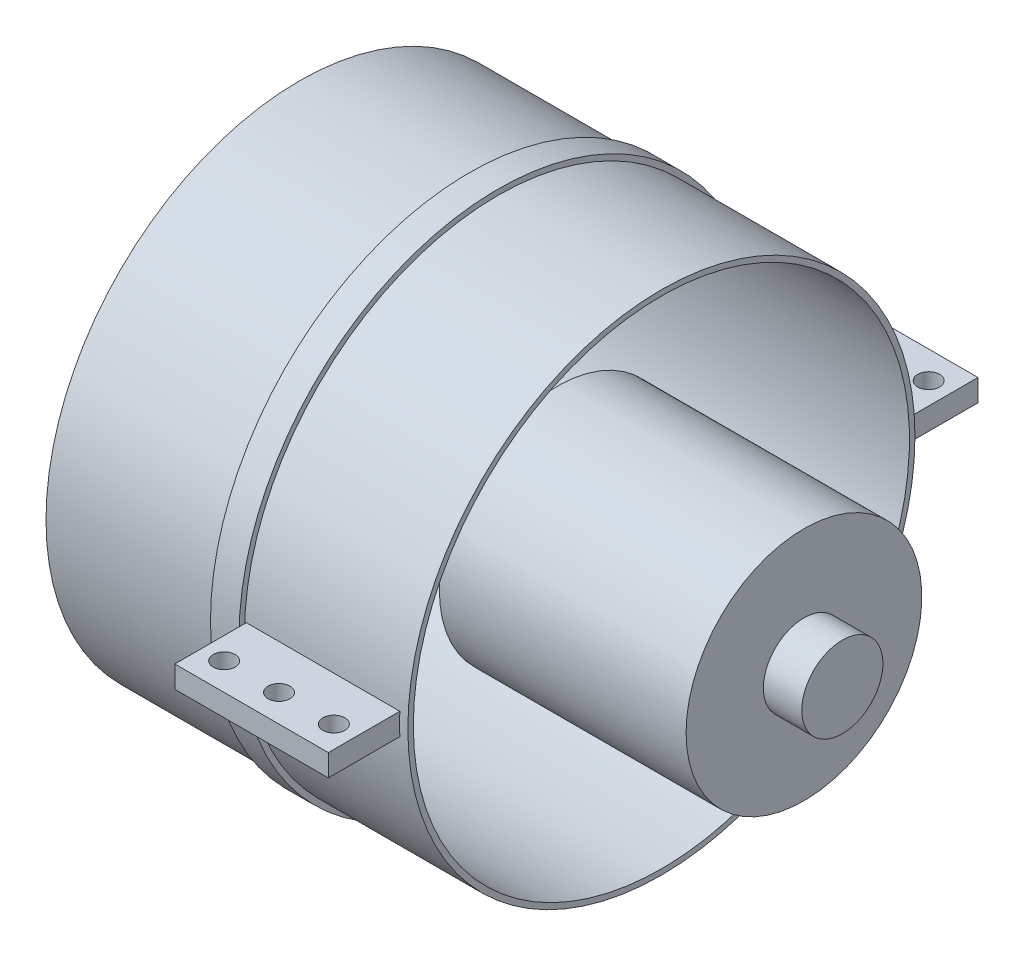
ISO-10303-21;
HEADER;
FILE_DESCRIPTION(('STEP AP214'),'2;1');
FILE_NAME('part.step','',(''),(''),'','','');
FILE_SCHEMA(('AUTOMOTIVE_DESIGN { 1 0 10303 214 1 1 1 1 }'));
ENDSEC;
DATA;
#1=APPLICATION_CONTEXT('core data for automotive mechanical design processes');
#2=APPLICATION_PROTOCOL_DEFINITION('international standard','automotive_design',2000,#1);
#3=PRODUCT_CONTEXT('',#1,'mechanical');
#4=PRODUCT('Part','Part','',(#3));
#5=PRODUCT_RELATED_PRODUCT_CATEGORY('part','',(#4));
#6=PRODUCT_DEFINITION_FORMATION('','',#4);
#7=PRODUCT_DEFINITION_CONTEXT('part definition',#1,'design');
#8=PRODUCT_DEFINITION('design','',#6,#7);
#9=PRODUCT_DEFINITION_SHAPE('','',#8);
#10=(LENGTH_UNIT() NAMED_UNIT(*) SI_UNIT(.MILLI.,.METRE.));
#11=(NAMED_UNIT(*) PLANE_ANGLE_UNIT() SI_UNIT($,.RADIAN.));
#12=(NAMED_UNIT(*) SI_UNIT($,.STERADIAN.) SOLID_ANGLE_UNIT());
#13=UNCERTAINTY_MEASURE_WITH_UNIT(LENGTH_MEASURE(1.E-05),#10,'distance_accuracy_value','');
#14=(GEOMETRIC_REPRESENTATION_CONTEXT(3) GLOBAL_UNCERTAINTY_ASSIGNED_CONTEXT((#13)) GLOBAL_UNIT_ASSIGNED_CONTEXT((#10,
#11,#12)) REPRESENTATION_CONTEXT('',''));
#15=CARTESIAN_POINT('',(0.,0.,0.));
#16=DIRECTION('',(0.,0.,1.));
#17=DIRECTION('',(1.,0.,0.));
#18=AXIS2_PLACEMENT_3D('',#15,#16,#17);
#19=CARTESIAN_POINT('',(47.,0.,0.));
#20=DIRECTION('',(1.,0.,0.));
#21=DIRECTION('',(0.,0.,-1.));
#22=AXIS2_PLACEMENT_3D('',#19,#20,#21);
#23=PLANE('',#22);
#24=CARTESIAN_POINT('',(47.,0.,0.));
#25=DIRECTION('',(-1.,0.,0.));
#26=DIRECTION('',(0.,0.,1.));
#27=AXIS2_PLACEMENT_3D('',#24,#25,#26);
#28=CIRCLE('',#27,21.5);
#29=CARTESIAN_POINT('',(47.,0.,21.5));
#30=VERTEX_POINT('',#29);
#31=EDGE_CURVE('E11',#30,#30,#28,.T.);
#32=ORIENTED_EDGE('',*,*,#31,.T.);
#33=EDGE_LOOP('',(#32));
#34=FACE_BOUND('',#33,.T.);
#35=ADVANCED_FACE('F40',(#34),#23,.F.);
#36=CARTESIAN_POINT('',(0.,0.,0.));
#37=DIRECTION('',(-1.,0.,0.));
#38=DIRECTION('',(0.,0.,1.));
#39=AXIS2_PLACEMENT_3D('',#36,#37,#38);
#40=CYLINDRICAL_SURFACE('',#39,21.5);
#41=ORIENTED_EDGE('',*,*,#31,.F.);
#42=EDGE_LOOP('',(#41));
#43=FACE_BOUND('',#42,.T.);
#44=CARTESIAN_POINT('',(92.,0.,0.));
#45=DIRECTION('',(-1.,0.,0.));
#46=DIRECTION('',(0.,0.,1.));
#47=AXIS2_PLACEMENT_3D('',#44,#45,#46);
#48=CIRCLE('',#47,21.5);
#49=CARTESIAN_POINT('',(92.,0.,21.5));
#50=VERTEX_POINT('',#49);
#51=EDGE_CURVE('E46',#50,#50,#48,.T.);
#52=ORIENTED_EDGE('',*,*,#51,.T.);
#53=EDGE_LOOP('',(#52));
#54=FACE_BOUND('',#53,.T.);
#55=ADVANCED_FACE('F72',(#43,#54),#40,.T.);
#56=CARTESIAN_POINT('',(92.,0.,-21.5));
#57=DIRECTION('',(-1.,0.,0.));
#58=DIRECTION('',(0.,0.,1.));
#59=AXIS2_PLACEMENT_3D('',#56,#57,#58);
#60=PLANE('',#59);
#61=ORIENTED_EDGE('',*,*,#51,.F.);
#62=EDGE_LOOP('',(#61));
#63=FACE_BOUND('',#62,.T.);
#64=CARTESIAN_POINT('',(92.,0.,0.));
#65=DIRECTION('',(-1.,0.,0.));
#66=DIRECTION('',(0.,0.,1.));
#67=AXIS2_PLACEMENT_3D('',#64,#65,#66);
#68=CIRCLE('',#67,7.4);
#69=CARTESIAN_POINT('',(92.,0.,7.4));
#70=VERTEX_POINT('',#69);
#71=EDGE_CURVE('E50',#70,#70,#68,.T.);
#72=ORIENTED_EDGE('',*,*,#71,.T.);
#73=EDGE_LOOP('',(#72));
#74=FACE_BOUND('',#73,.T.);
#75=ADVANCED_FACE('F68',(#63,#74),#60,.F.);
#76=CARTESIAN_POINT('',(0.,0.,0.));
#77=DIRECTION('',(-1.,0.,0.));
#78=DIRECTION('',(0.,0.,1.));
#79=AXIS2_PLACEMENT_3D('',#76,#77,#78);
#80=CYLINDRICAL_SURFACE('',#79,7.4);
#81=ORIENTED_EDGE('',*,*,#71,.F.);
#82=EDGE_LOOP('',(#81));
#83=FACE_BOUND('',#82,.T.);
#84=CARTESIAN_POINT('',(99.,0.,0.));
#85=DIRECTION('',(-1.,0.,0.));
#86=DIRECTION('',(0.,0.,1.));
#87=AXIS2_PLACEMENT_3D('',#84,#85,#86);
#88=CIRCLE('',#87,7.4);
#89=CARTESIAN_POINT('',(99.,0.,7.4));
#90=VERTEX_POINT('',#89);
#91=EDGE_CURVE('E54',#90,#90,#88,.T.);
#92=ORIENTED_EDGE('',*,*,#91,.T.);
#93=EDGE_LOOP('',(#92));
#94=FACE_BOUND('',#93,.T.);
#95=ADVANCED_FACE('F60',(#83,#94),#80,.T.);
#96=CARTESIAN_POINT('',(99.,0.,-7.4));
#97=DIRECTION('',(-1.,0.,0.));
#98=DIRECTION('',(0.,0.,1.));
#99=AXIS2_PLACEMENT_3D('',#96,#97,#98);
#100=PLANE('',#99);
#101=ORIENTED_EDGE('',*,*,#91,.F.);
#102=EDGE_LOOP('',(#101));
#103=FACE_BOUND('',#102,.T.);
#104=ADVANCED_FACE('F62',(#103),#100,.F.);
#105=CLOSED_SHELL('',(#35,#55,#75,#95,#104));
#106=MANIFOLD_SOLID_BREP('B2',#105);
#107=CARTESIAN_POINT('',(0.,0.,0.));
#108=DIRECTION('',(-1.,0.,0.));
#109=DIRECTION('',(0.,0.,1.));
#110=AXIS2_PLACEMENT_3D('',#107,#108,#109);
#111=CYLINDRICAL_SURFACE('',#110,45.25);
#112=CARTESIAN_POINT('',(66.,0.,0.));
#113=DIRECTION('',(-1.,0.,0.));
#114=DIRECTION('',(0.,0.,1.));
#115=AXIS2_PLACEMENT_3D('',#112,#113,#114);
#116=CIRCLE('',#115,45.25);
#117=CARTESIAN_POINT('',(66.,0.,45.25));
#118=VERTEX_POINT('',#117);
#119=EDGE_CURVE('E253',#118,#118,#116,.T.);
#120=ORIENTED_EDGE('',*,*,#119,.F.);
#121=EDGE_LOOP('',(#120));
#122=FACE_BOUND('',#121,.T.);
#123=CARTESIAN_POINT('',(0.,0.,0.));
#124=DIRECTION('',(-1.,0.,0.));
#125=DIRECTION('',(0.,0.,1.));
#126=AXIS2_PLACEMENT_3D('',#123,#124,#125);
#127=CIRCLE('',#126,45.25);
#128=CARTESIAN_POINT('',(0.,0.,45.25));
#129=VERTEX_POINT('',#128);
#130=EDGE_CURVE('E38',#129,#129,#127,.T.);
#131=ORIENTED_EDGE('',*,*,#130,.T.);
#132=EDGE_LOOP('',(#131));
#133=FACE_BOUND('',#132,.T.);
#134=ADVANCED_FACE('F110',(#122,#133),#111,.F.);
#135=CARTESIAN_POINT('',(0.,0.,-45.25));
#136=DIRECTION('',(1.,0.,0.));
#137=DIRECTION('',(0.,0.,-1.));
#138=AXIS2_PLACEMENT_3D('',#135,#136,#137);
#139=PLANE('',#138);
#140=ORIENTED_EDGE('',*,*,#130,.F.);
#141=EDGE_LOOP('',(#140));
#142=FACE_BOUND('',#141,.T.);
#143=CARTESIAN_POINT('',(0.,0.,0.));
#144=DIRECTION('',(-1.,0.,0.));
#145=DIRECTION('',(0.,0.,1.));
#146=AXIS2_PLACEMENT_3D('',#143,#144,#145);
#147=CIRCLE('',#146,46.25);
#148=CARTESIAN_POINT('',(0.,0.,46.25));
#149=VERTEX_POINT('',#148);
#150=EDGE_CURVE('E118',#149,#149,#147,.T.);
#151=ORIENTED_EDGE('',*,*,#150,.T.);
#152=EDGE_LOOP('',(#151));
#153=FACE_BOUND('',#152,.T.);
#154=ADVANCED_FACE('F335',(#142,#153),#139,.F.);
#155=CARTESIAN_POINT('',(0.,0.,0.));
#156=DIRECTION('',(-1.,0.,0.));
#157=DIRECTION('',(0.,0.,1.));
#158=AXIS2_PLACEMENT_3D('',#155,#156,#157);
#159=CYLINDRICAL_SURFACE('',#158,46.25);
#160=ORIENTED_EDGE('',*,*,#150,.F.);
#161=EDGE_LOOP('',(#160));
#162=FACE_BOUND('',#161,.T.);
#163=CARTESIAN_POINT('',(31.,0.,0.));
#164=DIRECTION('',(-1.,0.,0.));
#165=DIRECTION('',(0.,0.,1.));
#166=AXIS2_PLACEMENT_3D('',#163,#164,#165);
#167=CIRCLE('',#166,46.25);
#168=CARTESIAN_POINT('',(31.,0.,46.25));
#169=VERTEX_POINT('',#168);
#170=EDGE_CURVE('E273',#169,#169,#167,.T.);
#171=ORIENTED_EDGE('',*,*,#170,.T.);
#172=EDGE_LOOP('',(#171));
#173=FACE_BOUND('',#172,.T.);
#174=ADVANCED_FACE('F340',(#162,#173),#159,.T.);
#175=CARTESIAN_POINT('',(31.,0.,-46.25));
#176=DIRECTION('',(1.,0.,0.));
#177=DIRECTION('',(0.,0.,-1.));
#178=AXIS2_PLACEMENT_3D('',#175,#176,#177);
#179=PLANE('',#178);
#180=ORIENTED_EDGE('',*,*,#170,.F.);
#181=EDGE_LOOP('',(#180));
#182=FACE_BOUND('',#181,.T.);
#183=CARTESIAN_POINT('',(31.,0.,0.));
#184=DIRECTION('',(-1.,0.,0.));
#185=DIRECTION('',(0.,0.,1.));
#186=AXIS2_PLACEMENT_3D('',#183,#184,#185);
#187=CIRCLE('',#186,47.25);
#188=CARTESIAN_POINT('',(31.,0.,47.25));
#189=VERTEX_POINT('',#188);
#190=EDGE_CURVE('E270',#189,#189,#187,.T.);
#191=ORIENTED_EDGE('',*,*,#190,.T.);
#192=EDGE_LOOP('',(#191));
#193=FACE_BOUND('',#192,.T.);
#194=ADVANCED_FACE('F345',(#182,#193),#179,.F.);
#195=CARTESIAN_POINT('',(0.,0.,0.));
#196=DIRECTION('',(-1.,0.,0.));
#197=DIRECTION('',(0.,0.,1.));
#198=AXIS2_PLACEMENT_3D('',#195,#196,#197);
#199=CYLINDRICAL_SURFACE('',#198,47.25);
#200=ORIENTED_EDGE('',*,*,#190,.F.);
#201=EDGE_LOOP('',(#200));
#202=FACE_BOUND('',#201,.T.);
#203=CARTESIAN_POINT('',(36.2,0.,0.));
#204=DIRECTION('',(-1.,0.,0.));
#205=DIRECTION('',(0.,0.,1.));
#206=AXIS2_PLACEMENT_3D('',#203,#204,#205);
#207=CIRCLE('',#206,47.25);
#208=CARTESIAN_POINT('',(36.2,0.,47.25));
#209=VERTEX_POINT('',#208);
#210=EDGE_CURVE('E267',#209,#209,#207,.T.);
#211=ORIENTED_EDGE('',*,*,#210,.T.);
#212=EDGE_LOOP('',(#211));
#213=FACE_BOUND('',#212,.T.);
#214=ADVANCED_FACE('F351',(#202,#213),#199,.T.);
#215=CARTESIAN_POINT('',(36.2,0.,-47.25));
#216=DIRECTION('',(-1.,0.,0.));
#217=DIRECTION('',(0.,0.,1.));
#218=AXIS2_PLACEMENT_3D('',#215,#216,#217);
#219=PLANE('',#218);
#220=ORIENTED_EDGE('',*,*,#210,.F.);
#221=EDGE_LOOP('',(#220));
#222=FACE_BOUND('',#221,.T.);
#223=CARTESIAN_POINT('',(36.2,0.,0.));
#224=DIRECTION('',(-1.,0.,0.));
#225=DIRECTION('',(0.,0.,1.));
#226=AXIS2_PLACEMENT_3D('',#223,#224,#225);
#227=CIRCLE('',#226,46.25);
#228=CARTESIAN_POINT('',(36.2,0.,46.25));
#229=VERTEX_POINT('',#228);
#230=EDGE_CURVE('E264',#229,#229,#227,.T.);
#231=ORIENTED_EDGE('',*,*,#230,.T.);
#232=EDGE_LOOP('',(#231));
#233=FACE_BOUND('',#232,.T.);
#234=ADVANCED_FACE('F319',(#222,#233),#219,.F.);
#235=CARTESIAN_POINT('',(0.,0.,0.));
#236=DIRECTION('',(-1.,0.,0.));
#237=DIRECTION('',(0.,0.,1.));
#238=AXIS2_PLACEMENT_3D('',#235,#236,#237);
#239=CYLINDRICAL_SURFACE('',#238,46.25);
#240=DIRECTION('',(1.,0.,0.));
#241=VECTOR('',#240,1.);
#242=CARTESIAN_POINT('',(36.5,-2.,46.2067365218536));
#243=LINE('',#242,#241);
#244=CARTESIAN_POINT('',(36.5,-2.,46.2067365218536));
#245=VERTEX_POINT('',#244);
#246=CARTESIAN_POINT('',(64.5,-2.,46.2067365218536));
#247=VERTEX_POINT('',#246);
#248=EDGE_CURVE('E126',#245,#247,#243,.T.);
#249=ORIENTED_EDGE('',*,*,#248,.F.);
#250=CARTESIAN_POINT('',(36.5,0.,0.));
#251=DIRECTION('',(-1.,0.,0.));
#252=DIRECTION('',(0.,0.,-1.));
#253=AXIS2_PLACEMENT_3D('',#250,#251,#252);
#254=CIRCLE('',#253,46.25);
#255=CARTESIAN_POINT('',(36.5,2.,46.2067365218536));
#256=VERTEX_POINT('',#255);
#257=EDGE_CURVE('E130',#245,#256,#254,.T.);
#258=ORIENTED_EDGE('',*,*,#257,.T.);
#259=DIRECTION('',(1.,0.,0.));
#260=VECTOR('',#259,1.);
#261=CARTESIAN_POINT('',(36.5,2.,46.2067365218536));
#262=LINE('',#261,#260);
#263=CARTESIAN_POINT('',(64.5,2.,46.2067365218536));
#264=VERTEX_POINT('',#263);
#265=EDGE_CURVE('E186',#256,#264,#262,.T.);
#266=ORIENTED_EDGE('',*,*,#265,.T.);
#267=CARTESIAN_POINT('',(64.5,0.,0.));
#268=DIRECTION('',(-1.,0.,0.));
#269=DIRECTION('',(0.,0.,-1.));
#270=AXIS2_PLACEMENT_3D('',#267,#268,#269);
#271=CIRCLE('',#270,46.25);
#272=EDGE_CURVE('E202',#247,#264,#271,.T.);
#273=ORIENTED_EDGE('',*,*,#272,.F.);
#274=EDGE_LOOP('',(#249,#258,#266,#273));
#275=FACE_BOUND('',#274,.T.);
#276=DIRECTION('',(1.,0.,0.));
#277=VECTOR('',#276,1.);
#278=CARTESIAN_POINT('',(36.5,2.,-46.2067365218536));
#279=LINE('',#278,#277);
#280=CARTESIAN_POINT('',(36.5,2.,-46.2067365218536));
#281=VERTEX_POINT('',#280);
#282=CARTESIAN_POINT('',(64.5,2.,-46.2067365218536));
#283=VERTEX_POINT('',#282);
#284=EDGE_CURVE('E250',#281,#283,#279,.T.);
#285=ORIENTED_EDGE('',*,*,#284,.F.);
#286=CARTESIAN_POINT('',(36.5,0.,0.));
#287=DIRECTION('',(-1.,0.,0.));
#288=DIRECTION('',(0.,0.,1.));
#289=AXIS2_PLACEMENT_3D('',#286,#287,#288);
#290=CIRCLE('',#289,46.25);
#291=CARTESIAN_POINT('',(36.5,-2.,-46.2067365218536));
#292=VERTEX_POINT('',#291);
#293=EDGE_CURVE('E226',#281,#292,#290,.T.);
#294=ORIENTED_EDGE('',*,*,#293,.T.);
#295=DIRECTION('',(1.,0.,0.));
#296=VECTOR('',#295,1.);
#297=CARTESIAN_POINT('',(36.5,-2.,-46.2067365218536));
#298=LINE('',#297,#296);
#299=CARTESIAN_POINT('',(64.5,-2.,-46.2067365218536));
#300=VERTEX_POINT('',#299);
#301=EDGE_CURVE('E238',#292,#300,#298,.T.);
#302=ORIENTED_EDGE('',*,*,#301,.T.);
#303=CARTESIAN_POINT('',(64.5,0.,0.));
#304=DIRECTION('',(-1.,0.,0.));
#305=DIRECTION('',(0.,0.,1.));
#306=AXIS2_PLACEMENT_3D('',#303,#304,#305);
#307=CIRCLE('',#306,46.25);
#308=EDGE_CURVE('E239',#283,#300,#307,.T.);
#309=ORIENTED_EDGE('',*,*,#308,.F.);
#310=EDGE_LOOP('',(#285,#294,#302,#309));
#311=FACE_BOUND('',#310,.T.);
#312=ORIENTED_EDGE('',*,*,#230,.F.);
#313=EDGE_LOOP('',(#312));
#314=FACE_BOUND('',#313,.T.);
#315=CARTESIAN_POINT('',(66.,0.,0.));
#316=DIRECTION('',(-1.,0.,0.));
#317=DIRECTION('',(0.,0.,1.));
#318=AXIS2_PLACEMENT_3D('',#315,#316,#317);
#319=CIRCLE('',#318,46.25);
#320=CARTESIAN_POINT('',(66.,0.,46.25));
#321=VERTEX_POINT('',#320);
#322=EDGE_CURVE('E261',#321,#321,#319,.T.);
#323=ORIENTED_EDGE('',*,*,#322,.T.);
#324=EDGE_LOOP('',(#323));
#325=FACE_BOUND('',#324,.T.);
#326=ADVANCED_FACE('F315',(#275,#311,#314,#325),#239,.T.);
#327=CARTESIAN_POINT('',(66.,0.,-46.25));
#328=DIRECTION('',(-1.,0.,0.));
#329=DIRECTION('',(0.,0.,1.));
#330=AXIS2_PLACEMENT_3D('',#327,#328,#329);
#331=PLANE('',#330);
#332=ORIENTED_EDGE('',*,*,#322,.F.);
#333=EDGE_LOOP('',(#332));
#334=FACE_BOUND('',#333,.T.);
#335=ORIENTED_EDGE('',*,*,#119,.T.);
#336=EDGE_LOOP('',(#335));
#337=FACE_BOUND('',#336,.T.);
#338=ADVANCED_FACE('F318',(#334,#337),#331,.F.);
#339=CARTESIAN_POINT('',(36.5,2.,-59.25));
#340=DIRECTION('',(0.,1.,0.));
#341=DIRECTION('',(0.,0.,1.));
#342=AXIS2_PLACEMENT_3D('',#339,#340,#341);
#343=PLANE('',#342);
#344=CARTESIAN_POINT('',(40.5,2.,-54.25));
#345=DIRECTION('',(0.,1.,0.));
#346=DIRECTION('',(0.,0.,1.));
#347=AXIS2_PLACEMENT_3D('',#344,#345,#346);
#348=CIRCLE('',#347,2.);
#349=CARTESIAN_POINT('',(40.5,2.,-52.25));
#350=VERTEX_POINT('',#349);
#351=EDGE_CURVE('E212',#350,#350,#348,.T.);
#352=ORIENTED_EDGE('',*,*,#351,.F.);
#353=EDGE_LOOP('',(#352));
#354=FACE_BOUND('',#353,.T.);
#355=CARTESIAN_POINT('',(50.5,2.,-54.25));
#356=DIRECTION('',(0.,1.,0.));
#357=DIRECTION('',(0.,0.,1.));
#358=AXIS2_PLACEMENT_3D('',#355,#356,#357);
#359=CIRCLE('',#358,2.);
#360=CARTESIAN_POINT('',(50.5,2.,-52.25));
#361=VERTEX_POINT('',#360);
#362=EDGE_CURVE('E218',#361,#361,#359,.T.);
#363=ORIENTED_EDGE('',*,*,#362,.F.);
#364=EDGE_LOOP('',(#363));
#365=FACE_BOUND('',#364,.T.);
#366=CARTESIAN_POINT('',(60.5,2.,-54.25));
#367=DIRECTION('',(0.,1.,0.));
#368=DIRECTION('',(0.,0.,1.));
#369=AXIS2_PLACEMENT_3D('',#366,#367,#368);
#370=CIRCLE('',#369,2.);
#371=CARTESIAN_POINT('',(60.5,2.,-52.25));
#372=VERTEX_POINT('',#371);
#373=EDGE_CURVE('E222',#372,#372,#370,.T.);
#374=ORIENTED_EDGE('',*,*,#373,.F.);
#375=EDGE_LOOP('',(#374));
#376=FACE_BOUND('',#375,.T.);
#377=DIRECTION('',(0.,0.,1.));
#378=VECTOR('',#377,1.);
#379=CARTESIAN_POINT('',(64.5,2.,-59.25));
#380=LINE('',#379,#378);
#381=CARTESIAN_POINT('',(64.5,2.,-59.25));
#382=VERTEX_POINT('',#381);
#383=EDGE_CURVE('E229',#382,#283,#380,.T.);
#384=ORIENTED_EDGE('',*,*,#383,.F.);
#385=DIRECTION('',(1.,0.,0.));
#386=VECTOR('',#385,1.);
#387=CARTESIAN_POINT('',(36.5,2.,-59.25));
#388=LINE('',#387,#386);
#389=CARTESIAN_POINT('',(36.5,2.,-59.25));
#390=VERTEX_POINT('',#389);
#391=EDGE_CURVE('E254',#390,#382,#388,.T.);
#392=ORIENTED_EDGE('',*,*,#391,.F.);
#393=DIRECTION('',(0.,0.,1.));
#394=VECTOR('',#393,1.);
#395=CARTESIAN_POINT('',(36.5,2.,-59.25));
#396=LINE('',#395,#394);
#397=EDGE_CURVE('E235',#390,#281,#396,.T.);
#398=ORIENTED_EDGE('',*,*,#397,.T.);
#399=ORIENTED_EDGE('',*,*,#284,.T.);
#400=EDGE_LOOP('',(#384,#392,#398,#399));
#401=FACE_BOUND('',#400,.T.);
#402=ADVANCED_FACE('F329',(#354,#365,#376,#401),#343,.T.);
#403=CARTESIAN_POINT('',(36.5,-2.,-59.25));
#404=DIRECTION('',(0.,0.,-1.));
#405=DIRECTION('',(-1.,0.,0.));
#406=AXIS2_PLACEMENT_3D('',#403,#404,#405);
#407=PLANE('',#406);
#408=DIRECTION('',(0.,1.,0.));
#409=VECTOR('',#408,1.);
#410=CARTESIAN_POINT('',(64.5,-2.,-59.25));
#411=LINE('',#410,#409);
#412=CARTESIAN_POINT('',(64.5,-2.,-59.25));
#413=VERTEX_POINT('',#412);
#414=EDGE_CURVE('E245',#413,#382,#411,.T.);
#415=ORIENTED_EDGE('',*,*,#414,.F.);
#416=DIRECTION('',(1.,0.,0.));
#417=VECTOR('',#416,1.);
#418=CARTESIAN_POINT('',(36.5,-2.,-59.25));
#419=LINE('',#418,#417);
#420=CARTESIAN_POINT('',(36.5,-2.,-59.25));
#421=VERTEX_POINT('',#420);
#422=EDGE_CURVE('E256',#421,#413,#419,.T.);
#423=ORIENTED_EDGE('',*,*,#422,.F.);
#424=DIRECTION('',(0.,1.,0.));
#425=VECTOR('',#424,1.);
#426=CARTESIAN_POINT('',(36.5,-2.,-59.25));
#427=LINE('',#426,#425);
#428=EDGE_CURVE('E232',#421,#390,#427,.T.);
#429=ORIENTED_EDGE('',*,*,#428,.T.);
#430=ORIENTED_EDGE('',*,*,#391,.T.);
#431=EDGE_LOOP('',(#415,#423,#429,#430));
#432=FACE_BOUND('',#431,.T.);
#433=ADVANCED_FACE('F370',(#432),#407,.T.);
#434=CARTESIAN_POINT('',(36.5,-2.,-46.2067365218536));
#435=DIRECTION('',(0.,-1.,0.));
#436=DIRECTION('',(0.,0.,-1.));
#437=AXIS2_PLACEMENT_3D('',#434,#435,#436);
#438=PLANE('',#437);
#439=CARTESIAN_POINT('',(40.5,-2.,-54.25));
#440=DIRECTION('',(0.,-1.,0.));
#441=DIRECTION('',(0.,0.,-1.));
#442=AXIS2_PLACEMENT_3D('',#439,#440,#441);
#443=CIRCLE('',#442,2.);
#444=CARTESIAN_POINT('',(40.5,-2.,-56.25));
#445=VERTEX_POINT('',#444);
#446=EDGE_CURVE('E217',#445,#445,#443,.T.);
#447=ORIENTED_EDGE('',*,*,#446,.F.);
#448=EDGE_LOOP('',(#447));
#449=FACE_BOUND('',#448,.T.);
#450=CARTESIAN_POINT('',(50.5,-2.,-54.25));
#451=DIRECTION('',(0.,-1.,0.));
#452=DIRECTION('',(0.,0.,-1.));
#453=AXIS2_PLACEMENT_3D('',#450,#451,#452);
#454=CIRCLE('',#453,2.);
#455=CARTESIAN_POINT('',(50.5,-2.,-56.25));
#456=VERTEX_POINT('',#455);
#457=EDGE_CURVE('E221',#456,#456,#454,.T.);
#458=ORIENTED_EDGE('',*,*,#457,.F.);
#459=EDGE_LOOP('',(#458));
#460=FACE_BOUND('',#459,.T.);
#461=CARTESIAN_POINT('',(60.5,-2.,-54.25));
#462=DIRECTION('',(0.,-1.,0.));
#463=DIRECTION('',(0.,0.,-1.));
#464=AXIS2_PLACEMENT_3D('',#461,#462,#463);
#465=CIRCLE('',#464,2.);
#466=CARTESIAN_POINT('',(60.5,-2.,-56.25));
#467=VERTEX_POINT('',#466);
#468=EDGE_CURVE('E225',#467,#467,#465,.T.);
#469=ORIENTED_EDGE('',*,*,#468,.F.);
#470=EDGE_LOOP('',(#469));
#471=FACE_BOUND('',#470,.T.);
#472=DIRECTION('',(0.,0.,-1.));
#473=VECTOR('',#472,1.);
#474=CARTESIAN_POINT('',(64.5,-2.,-46.2067365218536));
#475=LINE('',#474,#473);
#476=EDGE_CURVE('E242',#300,#413,#475,.T.);
#477=ORIENTED_EDGE('',*,*,#476,.F.);
#478=ORIENTED_EDGE('',*,*,#301,.F.);
#479=DIRECTION('',(0.,0.,-1.));
#480=VECTOR('',#479,1.);
#481=CARTESIAN_POINT('',(36.5,-2.,-46.2067365218536));
#482=LINE('',#481,#480);
#483=EDGE_CURVE('E228',#292,#421,#482,.T.);
#484=ORIENTED_EDGE('',*,*,#483,.T.);
#485=ORIENTED_EDGE('',*,*,#422,.T.);
#486=EDGE_LOOP('',(#477,#478,#484,#485));
#487=FACE_BOUND('',#486,.T.);
#488=ADVANCED_FACE('F366',(#449,#460,#471,#487),#438,.T.);
#489=CARTESIAN_POINT('',(36.5,0.,0.));
#490=DIRECTION('',(-1.,0.,0.));
#491=DIRECTION('',(0.,0.,1.));
#492=AXIS2_PLACEMENT_3D('',#489,#490,#491);
#493=PLANE('',#492);
#494=ORIENTED_EDGE('',*,*,#293,.F.);
#495=ORIENTED_EDGE('',*,*,#397,.F.);
#496=ORIENTED_EDGE('',*,*,#428,.F.);
#497=ORIENTED_EDGE('',*,*,#483,.F.);
#498=EDGE_LOOP('',(#494,#495,#496,#497));
#499=FACE_BOUND('',#498,.T.);
#500=ADVANCED_FACE('F369',(#499),#493,.T.);
#501=CARTESIAN_POINT('',(64.5,0.,0.));
#502=DIRECTION('',(-1.,0.,0.));
#503=DIRECTION('',(0.,0.,1.));
#504=AXIS2_PLACEMENT_3D('',#501,#502,#503);
#505=PLANE('',#504);
#506=ORIENTED_EDGE('',*,*,#308,.T.);
#507=ORIENTED_EDGE('',*,*,#476,.T.);
#508=ORIENTED_EDGE('',*,*,#414,.T.);
#509=ORIENTED_EDGE('',*,*,#383,.T.);
#510=EDGE_LOOP('',(#506,#507,#508,#509));
#511=FACE_BOUND('',#510,.T.);
#512=ADVANCED_FACE('F378',(#511),#505,.F.);
#513=CARTESIAN_POINT('',(60.5,-47.25,-54.25));
#514=DIRECTION('',(0.,1.,0.));
#515=DIRECTION('',(0.,0.,1.));
#516=AXIS2_PLACEMENT_3D('',#513,#514,#515);
#517=CYLINDRICAL_SURFACE('',#516,2.);
#518=ORIENTED_EDGE('',*,*,#468,.T.);
#519=EDGE_LOOP('',(#518));
#520=FACE_BOUND('',#519,.T.);
#521=ORIENTED_EDGE('',*,*,#373,.T.);
#522=EDGE_LOOP('',(#521));
#523=FACE_BOUND('',#522,.T.);
#524=ADVANCED_FACE('F381',(#520,#523),#517,.F.);
#525=CARTESIAN_POINT('',(50.5,-47.25,-54.25));
#526=DIRECTION('',(0.,1.,0.));
#527=DIRECTION('',(0.,0.,1.));
#528=AXIS2_PLACEMENT_3D('',#525,#526,#527);
#529=CYLINDRICAL_SURFACE('',#528,2.);
#530=ORIENTED_EDGE('',*,*,#457,.T.);
#531=EDGE_LOOP('',(#530));
#532=FACE_BOUND('',#531,.T.);
#533=ORIENTED_EDGE('',*,*,#362,.T.);
#534=EDGE_LOOP('',(#533));
#535=FACE_BOUND('',#534,.T.);
#536=ADVANCED_FACE('F388',(#532,#535),#529,.F.);
#537=CARTESIAN_POINT('',(40.5,-47.25,-54.25));
#538=DIRECTION('',(0.,1.,0.));
#539=DIRECTION('',(0.,0.,1.));
#540=AXIS2_PLACEMENT_3D('',#537,#538,#539);
#541=CYLINDRICAL_SURFACE('',#540,2.);
#542=ORIENTED_EDGE('',*,*,#446,.T.);
#543=EDGE_LOOP('',(#542));
#544=FACE_BOUND('',#543,.T.);
#545=ORIENTED_EDGE('',*,*,#351,.T.);
#546=EDGE_LOOP('',(#545));
#547=FACE_BOUND('',#546,.T.);
#548=ADVANCED_FACE('F307',(#544,#547),#541,.F.);
#549=CARTESIAN_POINT('',(36.5,-2.,59.25));
#550=DIRECTION('',(0.,-1.,0.));
#551=DIRECTION('',(0.,0.,-1.));
#552=AXIS2_PLACEMENT_3D('',#549,#550,#551);
#553=PLANE('',#552);
#554=CARTESIAN_POINT('',(40.5,-2.,54.25));
#555=DIRECTION('',(0.,-1.,0.));
#556=DIRECTION('',(0.,0.,-1.));
#557=AXIS2_PLACEMENT_3D('',#554,#555,#556);
#558=CIRCLE('',#557,2.);
#559=CARTESIAN_POINT('',(40.5,-2.,52.25));
#560=VERTEX_POINT('',#559);
#561=EDGE_CURVE('E297',#560,#560,#558,.T.);
#562=ORIENTED_EDGE('',*,*,#561,.F.);
#563=EDGE_LOOP('',(#562));
#564=FACE_BOUND('',#563,.T.);
#565=CARTESIAN_POINT('',(50.5,-2.,54.25));
#566=DIRECTION('',(0.,-1.,0.));
#567=DIRECTION('',(0.,0.,-1.));
#568=AXIS2_PLACEMENT_3D('',#565,#566,#567);
#569=CIRCLE('',#568,2.);
#570=CARTESIAN_POINT('',(50.5,-2.,52.25));
#571=VERTEX_POINT('',#570);
#572=EDGE_CURVE('E288',#571,#571,#569,.T.);
#573=ORIENTED_EDGE('',*,*,#572,.F.);
#574=EDGE_LOOP('',(#573));
#575=FACE_BOUND('',#574,.T.);
#576=CARTESIAN_POINT('',(60.5,-2.,54.25));
#577=DIRECTION('',(0.,-1.,0.));
#578=DIRECTION('',(0.,0.,-1.));
#579=AXIS2_PLACEMENT_3D('',#576,#577,#578);
#580=CIRCLE('',#579,2.);
#581=CARTESIAN_POINT('',(60.5,-2.,52.25));
#582=VERTEX_POINT('',#581);
#583=EDGE_CURVE('E285',#582,#582,#580,.T.);
#584=ORIENTED_EDGE('',*,*,#583,.F.);
#585=EDGE_LOOP('',(#584));
#586=FACE_BOUND('',#585,.T.);
#587=DIRECTION('',(0.,0.,-1.));
#588=VECTOR('',#587,1.);
#589=CARTESIAN_POINT('',(64.5,-2.,59.25));
#590=LINE('',#589,#588);
#591=CARTESIAN_POINT('',(64.5,-2.,59.25));
#592=VERTEX_POINT('',#591);
#593=EDGE_CURVE('E197',#592,#247,#590,.T.);
#594=ORIENTED_EDGE('',*,*,#593,.F.);
#595=DIRECTION('',(1.,0.,0.));
#596=VECTOR('',#595,1.);
#597=CARTESIAN_POINT('',(36.5,-2.,59.25));
#598=LINE('',#597,#596);
#599=CARTESIAN_POINT('',(36.5,-2.,59.25));
#600=VERTEX_POINT('',#599);
#601=EDGE_CURVE('E185',#600,#592,#598,.T.);
#602=ORIENTED_EDGE('',*,*,#601,.F.);
#603=DIRECTION('',(0.,0.,-1.));
#604=VECTOR('',#603,1.);
#605=CARTESIAN_POINT('',(36.5,-2.,59.25));
#606=LINE('',#605,#604);
#607=EDGE_CURVE('E193',#600,#245,#606,.T.);
#608=ORIENTED_EDGE('',*,*,#607,.T.);
#609=ORIENTED_EDGE('',*,*,#248,.T.);
#610=EDGE_LOOP('',(#594,#602,#608,#609));
#611=FACE_BOUND('',#610,.T.);
#612=ADVANCED_FACE('F304',(#564,#575,#586,#611),#553,.T.);
#613=CARTESIAN_POINT('',(36.5,2.,59.25));
#614=DIRECTION('',(0.,0.,1.));
#615=DIRECTION('',(1.,0.,0.));
#616=AXIS2_PLACEMENT_3D('',#613,#614,#615);
#617=PLANE('',#616);
#618=DIRECTION('',(0.,-1.,0.));
#619=VECTOR('',#618,1.);
#620=CARTESIAN_POINT('',(64.5,2.,59.25));
#621=LINE('',#620,#619);
#622=CARTESIAN_POINT('',(64.5,2.,59.25));
#623=VERTEX_POINT('',#622);
#624=EDGE_CURVE('E180',#623,#592,#621,.T.);
#625=ORIENTED_EDGE('',*,*,#624,.F.);
#626=DIRECTION('',(1.,0.,0.));
#627=VECTOR('',#626,1.);
#628=CARTESIAN_POINT('',(36.5,2.,59.25));
#629=LINE('',#628,#627);
#630=CARTESIAN_POINT('',(36.5,2.,59.25));
#631=VERTEX_POINT('',#630);
#632=EDGE_CURVE('E174',#631,#623,#629,.T.);
#633=ORIENTED_EDGE('',*,*,#632,.F.);
#634=DIRECTION('',(0.,-1.,0.));
#635=VECTOR('',#634,1.);
#636=CARTESIAN_POINT('',(36.5,2.,59.25));
#637=LINE('',#636,#635);
#638=EDGE_CURVE('E177',#631,#600,#637,.T.);
#639=ORIENTED_EDGE('',*,*,#638,.T.);
#640=ORIENTED_EDGE('',*,*,#601,.T.);
#641=EDGE_LOOP('',(#625,#633,#639,#640));
#642=FACE_BOUND('',#641,.T.);
#643=ADVANCED_FACE('F176',(#642),#617,.T.);
#644=CARTESIAN_POINT('',(36.5,2.,46.2067365218536));
#645=DIRECTION('',(0.,1.,0.));
#646=DIRECTION('',(0.,0.,1.));
#647=AXIS2_PLACEMENT_3D('',#644,#645,#646);
#648=PLANE('',#647);
#649=CARTESIAN_POINT('',(40.5,2.,54.25));
#650=DIRECTION('',(0.,1.,0.));
#651=DIRECTION('',(0.,0.,1.));
#652=AXIS2_PLACEMENT_3D('',#649,#650,#651);
#653=CIRCLE('',#652,2.);
#654=CARTESIAN_POINT('',(40.5,2.,56.25));
#655=VERTEX_POINT('',#654);
#656=EDGE_CURVE('E113',#655,#655,#653,.T.);
#657=ORIENTED_EDGE('',*,*,#656,.F.);
#658=EDGE_LOOP('',(#657));
#659=FACE_BOUND('',#658,.T.);
#660=CARTESIAN_POINT('',(50.5,2.,54.25));
#661=DIRECTION('',(0.,1.,0.));
#662=DIRECTION('',(0.,0.,1.));
#663=AXIS2_PLACEMENT_3D('',#660,#661,#662);
#664=CIRCLE('',#663,2.);
#665=CARTESIAN_POINT('',(50.5,2.,56.25));
#666=VERTEX_POINT('',#665);
#667=EDGE_CURVE('E286',#666,#666,#664,.T.);
#668=ORIENTED_EDGE('',*,*,#667,.F.);
#669=EDGE_LOOP('',(#668));
#670=FACE_BOUND('',#669,.T.);
#671=CARTESIAN_POINT('',(60.5,2.,54.25));
#672=DIRECTION('',(0.,1.,0.));
#673=DIRECTION('',(0.,0.,1.));
#674=AXIS2_PLACEMENT_3D('',#671,#672,#673);
#675=CIRCLE('',#674,2.);
#676=CARTESIAN_POINT('',(60.5,2.,56.25));
#677=VERTEX_POINT('',#676);
#678=EDGE_CURVE('E206',#677,#677,#675,.T.);
#679=ORIENTED_EDGE('',*,*,#678,.F.);
#680=EDGE_LOOP('',(#679));
#681=FACE_BOUND('',#680,.T.);
#682=DIRECTION('',(0.,0.,1.));
#683=VECTOR('',#682,1.);
#684=CARTESIAN_POINT('',(64.5,2.,46.2067365218536));
#685=LINE('',#684,#683);
#686=EDGE_CURVE('E205',#264,#623,#685,.T.);
#687=ORIENTED_EDGE('',*,*,#686,.F.);
#688=ORIENTED_EDGE('',*,*,#265,.F.);
#689=DIRECTION('',(0.,0.,1.));
#690=VECTOR('',#689,1.);
#691=CARTESIAN_POINT('',(36.5,2.,46.2067365218536));
#692=LINE('',#691,#690);
#693=EDGE_CURVE('E191',#256,#631,#692,.T.);
#694=ORIENTED_EDGE('',*,*,#693,.T.);
#695=ORIENTED_EDGE('',*,*,#632,.T.);
#696=EDGE_LOOP('',(#687,#688,#694,#695));
#697=FACE_BOUND('',#696,.T.);
#698=ADVANCED_FACE('F195',(#659,#670,#681,#697),#648,.T.);
#699=CARTESIAN_POINT('',(36.5,0.,0.));
#700=DIRECTION('',(-1.,0.,0.));
#701=DIRECTION('',(0.,0.,-1.));
#702=AXIS2_PLACEMENT_3D('',#699,#700,#701);
#703=PLANE('',#702);
#704=ORIENTED_EDGE('',*,*,#257,.F.);
#705=ORIENTED_EDGE('',*,*,#607,.F.);
#706=ORIENTED_EDGE('',*,*,#638,.F.);
#707=ORIENTED_EDGE('',*,*,#693,.F.);
#708=EDGE_LOOP('',(#704,#705,#706,#707));
#709=FACE_BOUND('',#708,.T.);
#710=ADVANCED_FACE('F190',(#709),#703,.T.);
#711=CARTESIAN_POINT('',(64.5,0.,0.));
#712=DIRECTION('',(-1.,0.,0.));
#713=DIRECTION('',(0.,0.,-1.));
#714=AXIS2_PLACEMENT_3D('',#711,#712,#713);
#715=PLANE('',#714);
#716=ORIENTED_EDGE('',*,*,#272,.T.);
#717=ORIENTED_EDGE('',*,*,#686,.T.);
#718=ORIENTED_EDGE('',*,*,#624,.T.);
#719=ORIENTED_EDGE('',*,*,#593,.T.);
#720=EDGE_LOOP('',(#716,#717,#718,#719));
#721=FACE_BOUND('',#720,.T.);
#722=ADVANCED_FACE('F314',(#721),#715,.F.);
#723=CARTESIAN_POINT('',(60.5,47.25,54.25));
#724=DIRECTION('',(0.,-1.,0.));
#725=DIRECTION('',(0.,0.,-1.));
#726=AXIS2_PLACEMENT_3D('',#723,#724,#725);
#727=CYLINDRICAL_SURFACE('',#726,2.);
#728=ORIENTED_EDGE('',*,*,#678,.T.);
#729=EDGE_LOOP('',(#728));
#730=FACE_BOUND('',#729,.T.);
#731=ORIENTED_EDGE('',*,*,#583,.T.);
#732=EDGE_LOOP('',(#731));
#733=FACE_BOUND('',#732,.T.);
#734=ADVANCED_FACE('F403',(#730,#733),#727,.F.);
#735=CARTESIAN_POINT('',(50.5,47.25,54.25));
#736=DIRECTION('',(0.,-1.,0.));
#737=DIRECTION('',(0.,0.,-1.));
#738=AXIS2_PLACEMENT_3D('',#735,#736,#737);
#739=CYLINDRICAL_SURFACE('',#738,2.);
#740=ORIENTED_EDGE('',*,*,#667,.T.);
#741=EDGE_LOOP('',(#740));
#742=FACE_BOUND('',#741,.T.);
#743=ORIENTED_EDGE('',*,*,#572,.T.);
#744=EDGE_LOOP('',(#743));
#745=FACE_BOUND('',#744,.T.);
#746=ADVANCED_FACE('F408',(#742,#745),#739,.F.);
#747=CARTESIAN_POINT('',(40.5,47.25,54.25));
#748=DIRECTION('',(0.,-1.,0.));
#749=DIRECTION('',(0.,0.,-1.));
#750=AXIS2_PLACEMENT_3D('',#747,#748,#749);
#751=CYLINDRICAL_SURFACE('',#750,2.);
#752=ORIENTED_EDGE('',*,*,#656,.T.);
#753=EDGE_LOOP('',(#752));
#754=FACE_BOUND('',#753,.T.);
#755=ORIENTED_EDGE('',*,*,#561,.T.);
#756=EDGE_LOOP('',(#755));
#757=FACE_BOUND('',#756,.T.);
#758=ADVANCED_FACE('F302',(#754,#757),#751,.F.);
#759=CLOSED_SHELL('',(#134,#154,#174,#194,#214,#234,#326,#338,#402,#433,#488,#500,#512,#524,
#536,#548,#612,#643,#698,#710,#722,#734,#746,#758));
#760=MANIFOLD_SOLID_BREP('B6',#759);
#761=ADVANCED_BREP_SHAPE_REPRESENTATION('',(#18,#106,#760),#14);
#762=SHAPE_DEFINITION_REPRESENTATION(#9,#761);
ENDSEC;
END-ISO-10303-21;
